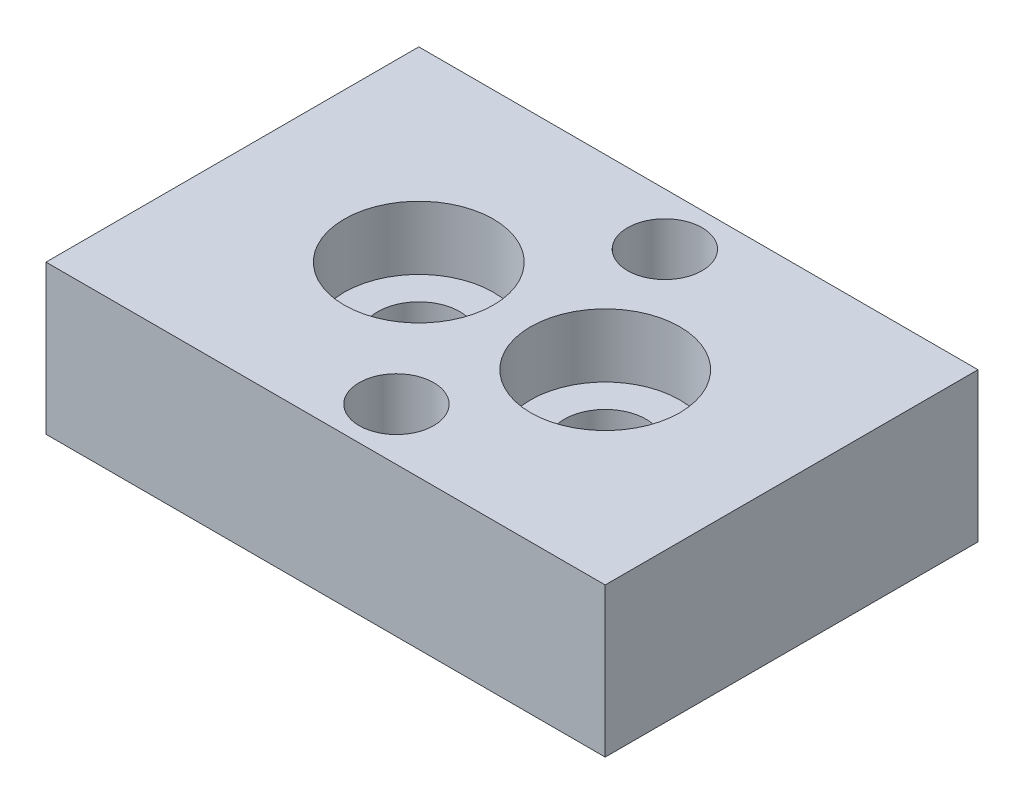
ISO-10303-21;
HEADER;
FILE_DESCRIPTION(('STEP AP214'),'2;1');
FILE_NAME('part.step','',(''),(''),'','','');
FILE_SCHEMA(('AUTOMOTIVE_DESIGN { 1 0 10303 214 1 1 1 1 }'));
ENDSEC;
DATA;
#1=APPLICATION_CONTEXT('core data for automotive mechanical design processes');
#2=APPLICATION_PROTOCOL_DEFINITION('international standard','automotive_design',2000,#1);
#3=PRODUCT_CONTEXT('',#1,'mechanical');
#4=PRODUCT('Part','Part','',(#3));
#5=PRODUCT_RELATED_PRODUCT_CATEGORY('part','',(#4));
#6=PRODUCT_DEFINITION_FORMATION('','',#4);
#7=PRODUCT_DEFINITION_CONTEXT('part definition',#1,'design');
#8=PRODUCT_DEFINITION('design','',#6,#7);
#9=PRODUCT_DEFINITION_SHAPE('','',#8);
#10=(LENGTH_UNIT() NAMED_UNIT(*) SI_UNIT(.MILLI.,.METRE.));
#11=(NAMED_UNIT(*) PLANE_ANGLE_UNIT() SI_UNIT($,.RADIAN.));
#12=(NAMED_UNIT(*) SI_UNIT($,.STERADIAN.) SOLID_ANGLE_UNIT());
#13=UNCERTAINTY_MEASURE_WITH_UNIT(LENGTH_MEASURE(1.E-05),#10,'distance_accuracy_value','');
#14=(GEOMETRIC_REPRESENTATION_CONTEXT(3) GLOBAL_UNCERTAINTY_ASSIGNED_CONTEXT((#13)) GLOBAL_UNIT_ASSIGNED_CONTEXT((#10,
#11,#12)) REPRESENTATION_CONTEXT('',''));
#15=CARTESIAN_POINT('',(0.,0.,0.));
#16=DIRECTION('',(0.,0.,1.));
#17=DIRECTION('',(1.,0.,0.));
#18=AXIS2_PLACEMENT_3D('',#15,#16,#17);
#19=CARTESIAN_POINT('',(10.,0.,-5.));
#20=DIRECTION('',(0.,1.,0.));
#21=DIRECTION('',(0.,0.,1.));
#22=AXIS2_PLACEMENT_3D('',#19,#20,#21);
#23=CYLINDRICAL_SURFACE('',#22,1.1);
#24=CARTESIAN_POINT('',(10.,0.,-5.));
#25=DIRECTION('',(0.,1.,0.));
#26=DIRECTION('',(0.,0.,1.));
#27=AXIS2_PLACEMENT_3D('',#24,#25,#26);
#28=CIRCLE('',#27,1.1);
#29=CARTESIAN_POINT('',(10.,0.,-3.9));
#30=VERTEX_POINT('',#29);
#31=EDGE_CURVE('E156',#30,#30,#28,.T.);
#32=ORIENTED_EDGE('',*,*,#31,.F.);
#33=EDGE_LOOP('',(#32));
#34=FACE_BOUND('',#33,.T.);
#35=CARTESIAN_POINT('',(10.,2.3,-5.));
#36=DIRECTION('',(0.,1.,0.));
#37=DIRECTION('',(0.,0.,1.));
#38=AXIS2_PLACEMENT_3D('',#35,#36,#37);
#39=CIRCLE('',#38,1.1);
#40=CARTESIAN_POINT('',(10.,2.3,-3.9));
#41=VERTEX_POINT('',#40);
#42=EDGE_CURVE('E42',#41,#41,#39,.F.);
#43=ORIENTED_EDGE('',*,*,#42,.F.);
#44=EDGE_LOOP('',(#43));
#45=FACE_BOUND('',#44,.T.);
#46=ADVANCED_FACE('F38',(#34,#45),#23,.F.);
#47=CARTESIAN_POINT('',(5.,0.,-5.));
#48=DIRECTION('',(0.,1.,0.));
#49=DIRECTION('',(0.,0.,1.));
#50=AXIS2_PLACEMENT_3D('',#47,#48,#49);
#51=CYLINDRICAL_SURFACE('',#50,1.1);
#52=CARTESIAN_POINT('',(5.,0.,-5.));
#53=DIRECTION('',(0.,1.,0.));
#54=DIRECTION('',(0.,0.,1.));
#55=AXIS2_PLACEMENT_3D('',#52,#53,#54);
#56=CIRCLE('',#55,1.1);
#57=CARTESIAN_POINT('',(5.,0.,-3.9));
#58=VERTEX_POINT('',#57);
#59=EDGE_CURVE('E115',#58,#58,#56,.T.);
#60=ORIENTED_EDGE('',*,*,#59,.F.);
#61=EDGE_LOOP('',(#60));
#62=FACE_BOUND('',#61,.T.);
#63=CARTESIAN_POINT('',(5.,2.3,-5.));
#64=DIRECTION('',(0.,1.,0.));
#65=DIRECTION('',(0.,0.,1.));
#66=AXIS2_PLACEMENT_3D('',#63,#64,#65);
#67=CIRCLE('',#66,1.1);
#68=CARTESIAN_POINT('',(5.,2.3,-3.9));
#69=VERTEX_POINT('',#68);
#70=EDGE_CURVE('E125',#69,#69,#67,.F.);
#71=ORIENTED_EDGE('',*,*,#70,.F.);
#72=EDGE_LOOP('',(#71));
#73=FACE_BOUND('',#72,.T.);
#74=ADVANCED_FACE('F180',(#62,#73),#51,.F.);
#75=CARTESIAN_POINT('',(0.,4.,0.));
#76=DIRECTION('',(1.,0.,0.));
#77=DIRECTION('',(0.,0.,-1.));
#78=AXIS2_PLACEMENT_3D('',#75,#76,#77);
#79=PLANE('',#78);
#80=DIRECTION('',(0.,0.,1.));
#81=VECTOR('',#80,1.);
#82=CARTESIAN_POINT('',(0.,0.,0.));
#83=LINE('',#82,#81);
#84=CARTESIAN_POINT('',(0.,0.,-10.));
#85=VERTEX_POINT('',#84);
#86=CARTESIAN_POINT('',(0.,0.,0.));
#87=VERTEX_POINT('',#86);
#88=EDGE_CURVE('E111',#85,#87,#83,.T.);
#89=ORIENTED_EDGE('',*,*,#88,.T.);
#90=DIRECTION('',(0.,-1.,0.));
#91=VECTOR('',#90,1.);
#92=CARTESIAN_POINT('',(0.,4.,0.));
#93=LINE('',#92,#91);
#94=CARTESIAN_POINT('',(0.,4.,0.));
#95=VERTEX_POINT('',#94);
#96=EDGE_CURVE('E11',#95,#87,#93,.T.);
#97=ORIENTED_EDGE('',*,*,#96,.F.);
#98=DIRECTION('',(0.,0.,1.));
#99=VECTOR('',#98,1.);
#100=CARTESIAN_POINT('',(0.,4.,0.));
#101=LINE('',#100,#99);
#102=CARTESIAN_POINT('',(0.,4.,-10.));
#103=VERTEX_POINT('',#102);
#104=EDGE_CURVE('E93',#103,#95,#101,.T.);
#105=ORIENTED_EDGE('',*,*,#104,.F.);
#106=DIRECTION('',(0.,-1.,0.));
#107=VECTOR('',#106,1.);
#108=CARTESIAN_POINT('',(0.,4.,-10.));
#109=LINE('',#108,#107);
#110=EDGE_CURVE('E107',#103,#85,#109,.T.);
#111=ORIENTED_EDGE('',*,*,#110,.T.);
#112=EDGE_LOOP('',(#89,#97,#105,#111));
#113=FACE_BOUND('',#112,.T.);
#114=ADVANCED_FACE('F40',(#113),#79,.F.);
#115=CARTESIAN_POINT('',(0.,4.,0.));
#116=DIRECTION('',(0.,0.,-1.));
#117=DIRECTION('',(-1.,0.,0.));
#118=AXIS2_PLACEMENT_3D('',#115,#116,#117);
#119=PLANE('',#118);
#120=DIRECTION('',(1.,0.,0.));
#121=VECTOR('',#120,1.);
#122=CARTESIAN_POINT('',(0.,0.,0.));
#123=LINE('',#122,#121);
#124=CARTESIAN_POINT('',(15.,0.,0.));
#125=VERTEX_POINT('',#124);
#126=EDGE_CURVE('E98',#87,#125,#123,.T.);
#127=ORIENTED_EDGE('',*,*,#126,.T.);
#128=DIRECTION('',(0.,-1.,0.));
#129=VECTOR('',#128,1.);
#130=CARTESIAN_POINT('',(15.,4.,0.));
#131=LINE('',#130,#129);
#132=CARTESIAN_POINT('',(15.,4.,0.));
#133=VERTEX_POINT('',#132);
#134=EDGE_CURVE('E49',#133,#125,#131,.T.);
#135=ORIENTED_EDGE('',*,*,#134,.F.);
#136=DIRECTION('',(1.,0.,0.));
#137=VECTOR('',#136,1.);
#138=CARTESIAN_POINT('',(0.,4.,0.));
#139=LINE('',#138,#137);
#140=EDGE_CURVE('E88',#95,#133,#139,.T.);
#141=ORIENTED_EDGE('',*,*,#140,.F.);
#142=ORIENTED_EDGE('',*,*,#96,.T.);
#143=EDGE_LOOP('',(#127,#135,#141,#142));
#144=FACE_BOUND('',#143,.T.);
#145=ADVANCED_FACE('F97',(#144),#119,.F.);
#146=CARTESIAN_POINT('',(15.,4.,0.));
#147=DIRECTION('',(-1.,0.,0.));
#148=DIRECTION('',(0.,0.,1.));
#149=AXIS2_PLACEMENT_3D('',#146,#147,#148);
#150=PLANE('',#149);
#151=DIRECTION('',(0.,0.,-1.));
#152=VECTOR('',#151,1.);
#153=CARTESIAN_POINT('',(15.,0.,0.));
#154=LINE('',#153,#152);
#155=CARTESIAN_POINT('',(15.,0.,-10.));
#156=VERTEX_POINT('',#155);
#157=EDGE_CURVE('E75',#125,#156,#154,.T.);
#158=ORIENTED_EDGE('',*,*,#157,.T.);
#159=DIRECTION('',(0.,-1.,0.));
#160=VECTOR('',#159,1.);
#161=CARTESIAN_POINT('',(15.,4.,-10.));
#162=LINE('',#161,#160);
#163=CARTESIAN_POINT('',(15.,4.,-10.));
#164=VERTEX_POINT('',#163);
#165=EDGE_CURVE('E100',#164,#156,#162,.T.);
#166=ORIENTED_EDGE('',*,*,#165,.F.);
#167=DIRECTION('',(0.,0.,-1.));
#168=VECTOR('',#167,1.);
#169=CARTESIAN_POINT('',(15.,4.,0.));
#170=LINE('',#169,#168);
#171=EDGE_CURVE('E91',#133,#164,#170,.T.);
#172=ORIENTED_EDGE('',*,*,#171,.F.);
#173=ORIENTED_EDGE('',*,*,#134,.T.);
#174=EDGE_LOOP('',(#158,#166,#172,#173));
#175=FACE_BOUND('',#174,.T.);
#176=ADVANCED_FACE('F102',(#175),#150,.F.);
#177=CARTESIAN_POINT('',(0.,4.,-10.));
#178=DIRECTION('',(0.,0.,1.));
#179=DIRECTION('',(1.,0.,0.));
#180=AXIS2_PLACEMENT_3D('',#177,#178,#179);
#181=PLANE('',#180);
#182=DIRECTION('',(-1.,0.,0.));
#183=VECTOR('',#182,1.);
#184=CARTESIAN_POINT('',(0.,0.,-10.));
#185=LINE('',#184,#183);
#186=EDGE_CURVE('E81',#156,#85,#185,.T.);
#187=ORIENTED_EDGE('',*,*,#186,.T.);
#188=ORIENTED_EDGE('',*,*,#110,.F.);
#189=DIRECTION('',(-1.,0.,0.));
#190=VECTOR('',#189,1.);
#191=CARTESIAN_POINT('',(0.,4.,-10.));
#192=LINE('',#191,#190);
#193=EDGE_CURVE('E58',#164,#103,#192,.T.);
#194=ORIENTED_EDGE('',*,*,#193,.F.);
#195=ORIENTED_EDGE('',*,*,#165,.T.);
#196=EDGE_LOOP('',(#187,#188,#194,#195));
#197=FACE_BOUND('',#196,.T.);
#198=ADVANCED_FACE('F222',(#197),#181,.F.);
#199=CARTESIAN_POINT('',(0.,4.,0.));
#200=DIRECTION('',(0.,-1.,0.));
#201=DIRECTION('',(0.,0.,-1.));
#202=AXIS2_PLACEMENT_3D('',#199,#200,#201);
#203=PLANE('',#202);
#204=CARTESIAN_POINT('',(5.,4.,-5.));
#205=DIRECTION('',(0.,1.,0.));
#206=DIRECTION('',(0.,0.,1.));
#207=AXIS2_PLACEMENT_3D('',#204,#205,#206);
#208=CIRCLE('',#207,2.);
#209=CARTESIAN_POINT('',(5.,4.,-3.));
#210=VERTEX_POINT('',#209);
#211=EDGE_CURVE('E135',#210,#210,#208,.T.);
#212=ORIENTED_EDGE('',*,*,#211,.F.);
#213=EDGE_LOOP('',(#212));
#214=FACE_BOUND('',#213,.T.);
#215=CARTESIAN_POINT('',(10.,4.,-5.));
#216=DIRECTION('',(0.,1.,0.));
#217=DIRECTION('',(0.,0.,1.));
#218=AXIS2_PLACEMENT_3D('',#215,#216,#217);
#219=CIRCLE('',#218,2.);
#220=CARTESIAN_POINT('',(10.,4.,-3.));
#221=VERTEX_POINT('',#220);
#222=EDGE_CURVE('E148',#221,#221,#219,.T.);
#223=ORIENTED_EDGE('',*,*,#222,.F.);
#224=EDGE_LOOP('',(#223));
#225=FACE_BOUND('',#224,.T.);
#226=CARTESIAN_POINT('',(8.,4.,-8.6));
#227=DIRECTION('',(0.,1.,0.));
#228=DIRECTION('',(0.,0.,1.));
#229=AXIS2_PLACEMENT_3D('',#226,#227,#228);
#230=CIRCLE('',#229,1.);
#231=CARTESIAN_POINT('',(8.,4.,-7.6));
#232=VERTEX_POINT('',#231);
#233=EDGE_CURVE('E157',#232,#232,#230,.T.);
#234=ORIENTED_EDGE('',*,*,#233,.F.);
#235=EDGE_LOOP('',(#234));
#236=FACE_BOUND('',#235,.T.);
#237=CARTESIAN_POINT('',(8.,4.,-1.4));
#238=DIRECTION('',(0.,1.,0.));
#239=DIRECTION('',(0.,0.,1.));
#240=AXIS2_PLACEMENT_3D('',#237,#238,#239);
#241=CIRCLE('',#240,1.);
#242=CARTESIAN_POINT('',(8.,4.,-0.399999999999999));
#243=VERTEX_POINT('',#242);
#244=EDGE_CURVE('E133',#243,#243,#241,.T.);
#245=ORIENTED_EDGE('',*,*,#244,.F.);
#246=EDGE_LOOP('',(#245));
#247=FACE_BOUND('',#246,.T.);
#248=ORIENTED_EDGE('',*,*,#104,.T.);
#249=ORIENTED_EDGE('',*,*,#140,.T.);
#250=ORIENTED_EDGE('',*,*,#171,.T.);
#251=ORIENTED_EDGE('',*,*,#193,.T.);
#252=EDGE_LOOP('',(#248,#249,#250,#251));
#253=FACE_BOUND('',#252,.T.);
#254=ADVANCED_FACE('F89',(#214,#225,#236,#247,#253),#203,.F.);
#255=CARTESIAN_POINT('',(0.,0.,0.));
#256=DIRECTION('',(0.,-1.,0.));
#257=DIRECTION('',(0.,0.,-1.));
#258=AXIS2_PLACEMENT_3D('',#255,#256,#257);
#259=PLANE('',#258);
#260=ORIENTED_EDGE('',*,*,#59,.T.);
#261=EDGE_LOOP('',(#260));
#262=FACE_BOUND('',#261,.T.);
#263=ORIENTED_EDGE('',*,*,#31,.T.);
#264=EDGE_LOOP('',(#263));
#265=FACE_BOUND('',#264,.T.);
#266=ORIENTED_EDGE('',*,*,#88,.F.);
#267=ORIENTED_EDGE('',*,*,#186,.F.);
#268=ORIENTED_EDGE('',*,*,#157,.F.);
#269=ORIENTED_EDGE('',*,*,#126,.F.);
#270=EDGE_LOOP('',(#266,#267,#268,#269));
#271=FACE_BOUND('',#270,.T.);
#272=ADVANCED_FACE('F175',(#262,#265,#271),#259,.T.);
#273=CARTESIAN_POINT('',(8.,1.,-1.4));
#274=DIRECTION('',(0.,1.,0.));
#275=DIRECTION('',(0.,0.,1.));
#276=AXIS2_PLACEMENT_3D('',#273,#274,#275);
#277=CYLINDRICAL_SURFACE('',#276,1.);
#278=CARTESIAN_POINT('',(8.,1.,-1.4));
#279=DIRECTION('',(0.,1.,0.));
#280=DIRECTION('',(0.,0.,1.));
#281=AXIS2_PLACEMENT_3D('',#278,#279,#280);
#282=CIRCLE('',#281,1.);
#283=CARTESIAN_POINT('',(8.,1.,-0.399999999999999));
#284=VERTEX_POINT('',#283);
#285=EDGE_CURVE('E161',#284,#284,#282,.T.);
#286=ORIENTED_EDGE('',*,*,#285,.F.);
#287=EDGE_LOOP('',(#286));
#288=FACE_BOUND('',#287,.T.);
#289=ORIENTED_EDGE('',*,*,#244,.T.);
#290=EDGE_LOOP('',(#289));
#291=FACE_BOUND('',#290,.T.);
#292=ADVANCED_FACE('F212',(#288,#291),#277,.F.);
#293=CARTESIAN_POINT('',(8.,1.,-1.4));
#294=DIRECTION('',(0.,1.,0.));
#295=DIRECTION('',(0.,0.,1.));
#296=AXIS2_PLACEMENT_3D('',#293,#294,#295);
#297=PLANE('',#296);
#298=ORIENTED_EDGE('',*,*,#285,.T.);
#299=EDGE_LOOP('',(#298));
#300=FACE_BOUND('',#299,.T.);
#301=ADVANCED_FACE('F208',(#300),#297,.T.);
#302=CARTESIAN_POINT('',(8.,1.,-8.6));
#303=DIRECTION('',(0.,1.,0.));
#304=DIRECTION('',(0.,0.,1.));
#305=AXIS2_PLACEMENT_3D('',#302,#303,#304);
#306=CYLINDRICAL_SURFACE('',#305,1.);
#307=CARTESIAN_POINT('',(8.,1.,-8.6));
#308=DIRECTION('',(0.,1.,0.));
#309=DIRECTION('',(0.,0.,1.));
#310=AXIS2_PLACEMENT_3D('',#307,#308,#309);
#311=CIRCLE('',#310,1.);
#312=CARTESIAN_POINT('',(8.,1.,-7.6));
#313=VERTEX_POINT('',#312);
#314=EDGE_CURVE('E152',#313,#313,#311,.T.);
#315=ORIENTED_EDGE('',*,*,#314,.F.);
#316=EDGE_LOOP('',(#315));
#317=FACE_BOUND('',#316,.T.);
#318=ORIENTED_EDGE('',*,*,#233,.T.);
#319=EDGE_LOOP('',(#318));
#320=FACE_BOUND('',#319,.T.);
#321=ADVANCED_FACE('F204',(#317,#320),#306,.F.);
#322=CARTESIAN_POINT('',(8.,1.,-8.6));
#323=DIRECTION('',(0.,1.,0.));
#324=DIRECTION('',(0.,0.,1.));
#325=AXIS2_PLACEMENT_3D('',#322,#323,#324);
#326=PLANE('',#325);
#327=ORIENTED_EDGE('',*,*,#314,.T.);
#328=EDGE_LOOP('',(#327));
#329=FACE_BOUND('',#328,.T.);
#330=ADVANCED_FACE('F201',(#329),#326,.T.);
#331=CARTESIAN_POINT('',(5.,2.3,-5.));
#332=DIRECTION('',(0.,1.,0.));
#333=DIRECTION('',(0.,0.,1.));
#334=AXIS2_PLACEMENT_3D('',#331,#332,#333);
#335=PLANE('',#334);
#336=CARTESIAN_POINT('',(5.,2.3,-5.));
#337=DIRECTION('',(0.,1.,0.));
#338=DIRECTION('',(0.,0.,1.));
#339=AXIS2_PLACEMENT_3D('',#336,#337,#338);
#340=CIRCLE('',#339,2.);
#341=CARTESIAN_POINT('',(5.,2.3,-3.));
#342=VERTEX_POINT('',#341);
#343=EDGE_CURVE('E128',#342,#342,#340,.T.);
#344=ORIENTED_EDGE('',*,*,#343,.T.);
#345=EDGE_LOOP('',(#344));
#346=FACE_BOUND('',#345,.T.);
#347=ORIENTED_EDGE('',*,*,#70,.T.);
#348=EDGE_LOOP('',(#347));
#349=FACE_BOUND('',#348,.T.);
#350=ADVANCED_FACE('F196',(#346,#349),#335,.T.);
#351=CARTESIAN_POINT('',(5.,2.3,-5.));
#352=DIRECTION('',(0.,1.,0.));
#353=DIRECTION('',(0.,0.,1.));
#354=AXIS2_PLACEMENT_3D('',#351,#352,#353);
#355=CYLINDRICAL_SURFACE('',#354,2.);
#356=ORIENTED_EDGE('',*,*,#343,.F.);
#357=EDGE_LOOP('',(#356));
#358=FACE_BOUND('',#357,.T.);
#359=ORIENTED_EDGE('',*,*,#211,.T.);
#360=EDGE_LOOP('',(#359));
#361=FACE_BOUND('',#360,.T.);
#362=ADVANCED_FACE('F187',(#358,#361),#355,.F.);
#363=CARTESIAN_POINT('',(10.,2.3,-5.));
#364=DIRECTION('',(0.,1.,0.));
#365=DIRECTION('',(0.,0.,1.));
#366=AXIS2_PLACEMENT_3D('',#363,#364,#365);
#367=PLANE('',#366);
#368=CARTESIAN_POINT('',(10.,2.3,-5.));
#369=DIRECTION('',(0.,1.,0.));
#370=DIRECTION('',(0.,0.,1.));
#371=AXIS2_PLACEMENT_3D('',#368,#369,#370);
#372=CIRCLE('',#371,2.);
#373=CARTESIAN_POINT('',(10.,2.3,-3.));
#374=VERTEX_POINT('',#373);
#375=EDGE_CURVE('E142',#374,#374,#372,.T.);
#376=ORIENTED_EDGE('',*,*,#375,.T.);
#377=EDGE_LOOP('',(#376));
#378=FACE_BOUND('',#377,.T.);
#379=ORIENTED_EDGE('',*,*,#42,.T.);
#380=EDGE_LOOP('',(#379));
#381=FACE_BOUND('',#380,.T.);
#382=ADVANCED_FACE('F184',(#378,#381),#367,.T.);
#383=CARTESIAN_POINT('',(10.,2.3,-5.));
#384=DIRECTION('',(0.,1.,0.));
#385=DIRECTION('',(0.,0.,1.));
#386=AXIS2_PLACEMENT_3D('',#383,#384,#385);
#387=CYLINDRICAL_SURFACE('',#386,2.);
#388=ORIENTED_EDGE('',*,*,#375,.F.);
#389=EDGE_LOOP('',(#388));
#390=FACE_BOUND('',#389,.T.);
#391=ORIENTED_EDGE('',*,*,#222,.T.);
#392=EDGE_LOOP('',(#391));
#393=FACE_BOUND('',#392,.T.);
#394=ADVANCED_FACE('F186',(#390,#393),#387,.F.);
#395=CLOSED_SHELL('',(#46,#74,#114,#145,#176,#198,#254,#272,#292,#301,#321,#330,#350,#362,#382,#394));
#396=MANIFOLD_SOLID_BREP('B2',#395);
#397=ADVANCED_BREP_SHAPE_REPRESENTATION('',(#18,#396),#14);
#398=SHAPE_DEFINITION_REPRESENTATION(#9,#397);
ENDSEC;
END-ISO-10303-21;
